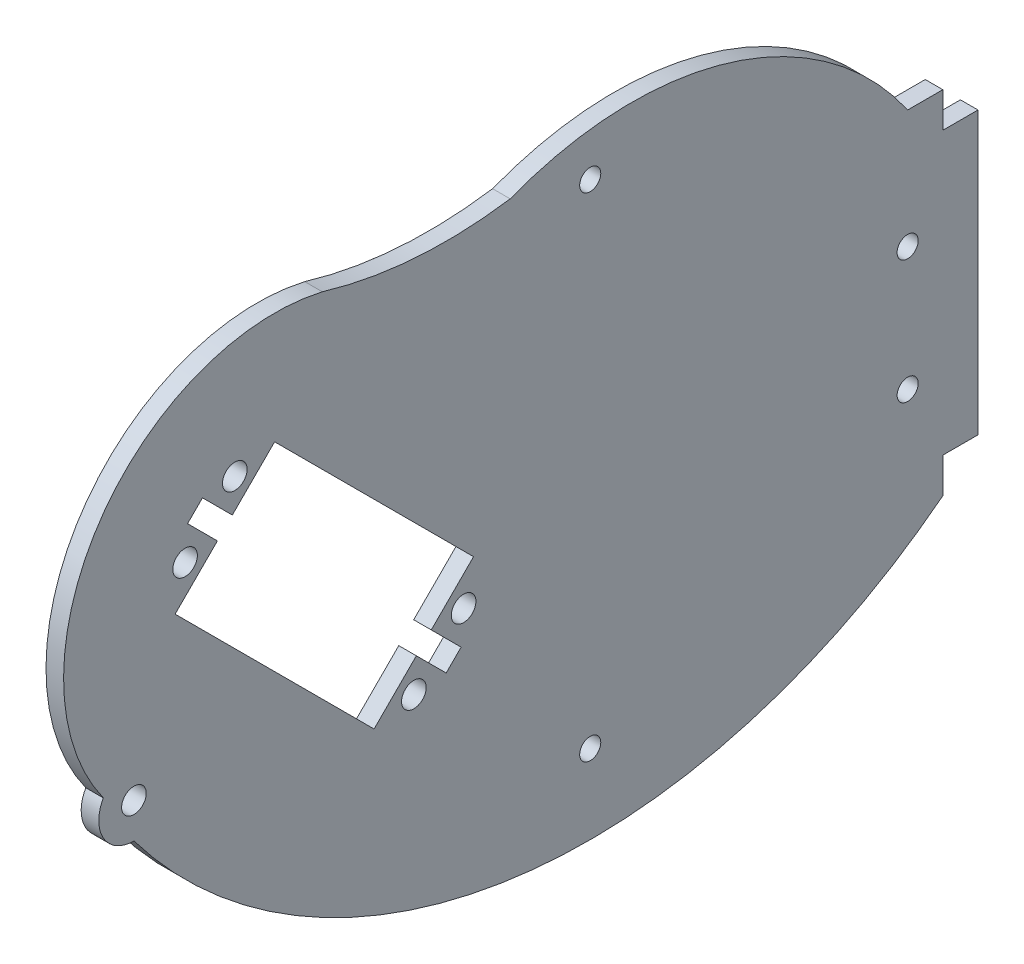
ISO-10303-21;
HEADER;
FILE_DESCRIPTION(('STEP AP214'),'2;1');
FILE_NAME('part.step','',(''),(''),'','','');
FILE_SCHEMA(('AUTOMOTIVE_DESIGN { 1 0 10303 214 1 1 1 1 }'));
ENDSEC;
DATA;
#1=APPLICATION_CONTEXT('core data for automotive mechanical design processes');
#2=APPLICATION_PROTOCOL_DEFINITION('international standard','automotive_design',2000,#1);
#3=PRODUCT_CONTEXT('',#1,'mechanical');
#4=PRODUCT('Part','Part','',(#3));
#5=PRODUCT_RELATED_PRODUCT_CATEGORY('part','',(#4));
#6=PRODUCT_DEFINITION_FORMATION('','',#4);
#7=PRODUCT_DEFINITION_CONTEXT('part definition',#1,'design');
#8=PRODUCT_DEFINITION('design','',#6,#7);
#9=PRODUCT_DEFINITION_SHAPE('','',#8);
#10=(LENGTH_UNIT() NAMED_UNIT(*) SI_UNIT(.MILLI.,.METRE.));
#11=(NAMED_UNIT(*) PLANE_ANGLE_UNIT() SI_UNIT($,.RADIAN.));
#12=(NAMED_UNIT(*) SI_UNIT($,.STERADIAN.) SOLID_ANGLE_UNIT());
#13=UNCERTAINTY_MEASURE_WITH_UNIT(LENGTH_MEASURE(1.E-05),#10,'distance_accuracy_value','');
#14=(GEOMETRIC_REPRESENTATION_CONTEXT(3) GLOBAL_UNCERTAINTY_ASSIGNED_CONTEXT((#13)) GLOBAL_UNIT_ASSIGNED_CONTEXT((#10,
#11,#12)) REPRESENTATION_CONTEXT('',''));
#15=CARTESIAN_POINT('',(0.,0.,0.));
#16=DIRECTION('',(0.,0.,1.));
#17=DIRECTION('',(1.,0.,0.));
#18=AXIS2_PLACEMENT_3D('',#15,#16,#17);
#19=CARTESIAN_POINT('',(2.5,-17.1347764973668,-50.7819266532157));
#20=DIRECTION('',(-1.,0.,0.));
#21=DIRECTION('',(0.,0.,1.));
#22=AXIS2_PLACEMENT_3D('',#19,#20,#21);
#23=PLANE('',#22);
#24=CARTESIAN_POINT('',(2.5,-46.0487768139737,-44.8711988503029));
#25=DIRECTION('',(1.,0.,0.));
#26=DIRECTION('',(0.,0.,-1.));
#27=AXIS2_PLACEMENT_3D('',#24,#25,#26);
#28=CIRCLE('',#27,1.5);
#29=CARTESIAN_POINT('',(2.5,-46.0487768139737,-46.3711988503029));
#30=VERTEX_POINT('',#29);
#31=EDGE_CURVE('E734',#30,#30,#28,.T.);
#32=ORIENTED_EDGE('',*,*,#31,.F.);
#33=EDGE_LOOP('',(#32));
#34=FACE_BOUND('',#33,.T.);
#35=CARTESIAN_POINT('',(2.5,-6.82118373479745,-89.9999999999999));
#36=DIRECTION('',(1.,0.,0.));
#37=DIRECTION('',(0.,0.,-1.));
#38=AXIS2_PLACEMENT_3D('',#35,#36,#37);
#39=CIRCLE('',#38,1.5);
#40=CARTESIAN_POINT('',(2.5,-6.82118373479745,-91.4999999999999));
#41=VERTEX_POINT('',#40);
#42=EDGE_CURVE('E746',#41,#41,#39,.T.);
#43=ORIENTED_EDGE('',*,*,#42,.F.);
#44=EDGE_LOOP('',(#43));
#45=FACE_BOUND('',#44,.T.);
#46=CARTESIAN_POINT('',(2.5,-26.8718903733424,-19.7971571849698));
#47=DIRECTION('',(1.,0.,0.));
#48=DIRECTION('',(0.,0.,-1.));
#49=AXIS2_PLACEMENT_3D('',#46,#47,#48);
#50=CIRCLE('',#49,1.74999999999991);
#51=CARTESIAN_POINT('',(2.5,-26.8718903733424,-21.5471571849697));
#52=VERTEX_POINT('',#51);
#53=EDGE_CURVE('E758',#52,#52,#50,.T.);
#54=ORIENTED_EDGE('',*,*,#53,.F.);
#55=EDGE_LOOP('',(#54));
#56=FACE_BOUND('',#55,.T.);
#57=CARTESIAN_POINT('',(2.5,12.7262989582942,5.65847735255609));
#58=DIRECTION('',(1.,0.,0.));
#59=DIRECTION('',(0.,0.,-1.));
#60=AXIS2_PLACEMENT_3D('',#57,#58,#59);
#61=CIRCLE('',#60,1.74999999999999);
#62=CARTESIAN_POINT('',(2.5,12.7262989582942,3.90847735255609));
#63=VERTEX_POINT('',#62);
#64=EDGE_CURVE('E770',#63,#63,#61,.T.);
#65=ORIENTED_EDGE('',*,*,#64,.F.);
#66=EDGE_LOOP('',(#65));
#67=FACE_BOUND('',#66,.T.);
#68=DIRECTION('',(0.,0.707106781186543,-0.707106781186552));
#69=VECTOR('',#68,1.);
#70=CARTESIAN_POINT('',(2.5,-20.1525432638166,-22.2738636073762));
#71=LINE('',#70,#69);
#72=CARTESIAN_POINT('',(2.5,-20.1525432638166,-22.2738636073762));
#73=VERTEX_POINT('',#72);
#74=CARTESIAN_POINT('',(2.5,-14.1421356237309,-28.2842712474619));
#75=VERTEX_POINT('',#74);
#76=EDGE_CURVE('E187',#73,#75,#71,.T.);
#77=ORIENTED_EDGE('',*,*,#76,.F.);
#78=DIRECTION('',(0.,0.707106781186549,0.707106781186546));
#79=VECTOR('',#78,1.);
#80=CARTESIAN_POINT('',(2.5,-24.3951839509359,-26.5165042944955));
#81=LINE('',#80,#79);
#82=CARTESIAN_POINT('',(2.5,-24.3951839509359,-26.5165042944955));
#83=VERTEX_POINT('',#82);
#84=EDGE_CURVE('E230',#83,#73,#81,.T.);
#85=ORIENTED_EDGE('',*,*,#84,.F.);
#86=DIRECTION('',(0.,0.707106781186551,-0.707106781186544));
#87=VECTOR('',#86,1.);
#88=CARTESIAN_POINT('',(2.5,-26.5183369827491,-24.3933512626823));
#89=LINE('',#88,#87);
#90=CARTESIAN_POINT('',(2.5,-26.5183369827491,-24.3933512626823));
#91=VERTEX_POINT('',#90);
#92=EDGE_CURVE('E228',#91,#83,#89,.T.);
#93=ORIENTED_EDGE('',*,*,#92,.F.);
#94=DIRECTION('',(0.,-0.707106781186558,-0.707106781186537));
#95=VECTOR('',#94,1.);
#96=CARTESIAN_POINT('',(2.5,-22.2756962956298,-20.150710575563));
#97=LINE('',#96,#95);
#98=CARTESIAN_POINT('',(2.5,-22.2756962956298,-20.150710575563));
#99=VERTEX_POINT('',#98);
#100=EDGE_CURVE('E226',#99,#91,#97,.T.);
#101=ORIENTED_EDGE('',*,*,#100,.F.);
#102=DIRECTION('',(0.,0.707106781186548,-0.707106781186547));
#103=VECTOR('',#102,1.);
#104=CARTESIAN_POINT('',(2.5,-28.2842712474619,-14.142135623731));
#105=LINE('',#104,#103);
#106=CARTESIAN_POINT('',(2.5,-28.2842712474619,-14.142135623731));
#107=VERTEX_POINT('',#106);
#108=EDGE_CURVE('E224',#107,#99,#105,.T.);
#109=ORIENTED_EDGE('',*,*,#108,.F.);
#110=DIRECTION('',(0.,-0.707106781186547,-0.707106781186548));
#111=VECTOR('',#110,1.);
#112=CARTESIAN_POINT('',(2.5,0.,14.142135623731));
#113=LINE('',#112,#111);
#114=CARTESIAN_POINT('',(2.5,0.,14.142135623731));
#115=VERTEX_POINT('',#114);
#116=EDGE_CURVE('E222',#115,#107,#113,.T.);
#117=ORIENTED_EDGE('',*,*,#116,.F.);
#118=DIRECTION('',(0.,-0.707106781186548,0.707106781186547));
#119=VECTOR('',#118,1.);
#120=CARTESIAN_POINT('',(2.5,6.01040764008564,8.1317279836453));
#121=LINE('',#120,#119);
#122=CARTESIAN_POINT('',(2.5,6.01040764008564,8.1317279836453));
#123=VERTEX_POINT('',#122);
#124=EDGE_CURVE('E220',#123,#115,#121,.T.);
#125=ORIENTED_EDGE('',*,*,#124,.F.);
#126=DIRECTION('',(0.,-0.707106781186547,-0.707106781186548));
#127=VECTOR('',#126,1.);
#128=CARTESIAN_POINT('',(2.5,10.2530483272049,12.3743686707646));
#129=LINE('',#128,#127);
#130=CARTESIAN_POINT('',(2.5,10.2530483272049,12.3743686707646));
#131=VERTEX_POINT('',#130);
#132=EDGE_CURVE('E218',#131,#123,#129,.T.);
#133=ORIENTED_EDGE('',*,*,#132,.F.);
#134=DIRECTION('',(0.,-0.707106781186547,0.707106781186547));
#135=VECTOR('',#134,1.);
#136=CARTESIAN_POINT('',(2.5,12.3743686707646,10.253048327205));
#137=LINE('',#136,#135);
#138=CARTESIAN_POINT('',(2.5,12.3743686707646,10.253048327205));
#139=VERTEX_POINT('',#138);
#140=EDGE_CURVE('E216',#139,#131,#137,.T.);
#141=ORIENTED_EDGE('',*,*,#140,.F.);
#142=DIRECTION('',(0.,0.707106781186547,0.707106781186548));
#143=VECTOR('',#142,1.);
#144=CARTESIAN_POINT('',(2.5,8.13172798364529,6.01040764008567));
#145=LINE('',#144,#143);
#146=CARTESIAN_POINT('',(2.5,8.13172798364529,6.01040764008567));
#147=VERTEX_POINT('',#146);
#148=EDGE_CURVE('E211',#147,#139,#145,.T.);
#149=ORIENTED_EDGE('',*,*,#148,.F.);
#150=DIRECTION('',(0.,-0.707106781186546,0.707106781186549));
#151=VECTOR('',#150,1.);
#152=CARTESIAN_POINT('',(2.5,14.1421356237309,0.));
#153=LINE('',#152,#151);
#154=CARTESIAN_POINT('',(2.5,14.1421356237309,0.));
#155=VERTEX_POINT('',#154);
#156=EDGE_CURVE('E209',#155,#147,#153,.T.);
#157=ORIENTED_EDGE('',*,*,#156,.F.);
#158=DIRECTION('',(0.,0.707106781186547,0.707106781186548));
#159=VECTOR('',#158,1.);
#160=CARTESIAN_POINT('',(2.5,-14.1421356237309,-28.2842712474619));
#161=LINE('',#160,#159);
#162=EDGE_CURVE('E195',#75,#155,#161,.T.);
#163=ORIENTED_EDGE('',*,*,#162,.F.);
#164=EDGE_LOOP('',(#77,#85,#93,#101,#109,#117,#125,#133,#141,#149,#157,#163));
#165=FACE_BOUND('',#164,.T.);
#166=CARTESIAN_POINT('',(2.5,-17.1347764973668,-50.7819266532157));
#167=DIRECTION('',(1.,0.,0.));
#168=DIRECTION('',(0.,0.,1.));
#169=AXIS2_PLACEMENT_3D('',#166,#167,#168);
#170=CIRCLE('',#169,47.6901810920843);
#171=CARTESIAN_POINT('',(2.5,10.,-89.9999999999999));
#172=VERTEX_POINT('',#171);
#173=CARTESIAN_POINT('',(2.5,27.3116487053127,-33.4941084190252));
#174=VERTEX_POINT('',#173);
#175=EDGE_CURVE('E283',#172,#174,#170,.T.);
#176=ORIENTED_EDGE('',*,*,#175,.T.);
#177=CARTESIAN_POINT('',(2.5,87.7830578531458,-24.3979033665495));
#178=DIRECTION('',(-1.,0.,0.));
#179=DIRECTION('',(0.,0.,-1.));
#180=AXIS2_PLACEMENT_3D('',#177,#178,#179);
#181=CIRCLE('',#180,61.1517151900199);
#182=CARTESIAN_POINT('',(2.5,29.2225875766442,-6.78530583874873));
#183=VERTEX_POINT('',#182);
#184=EDGE_CURVE('E286',#174,#183,#181,.T.);
#185=ORIENTED_EDGE('',*,*,#184,.T.);
#186=CARTESIAN_POINT('',(2.5,0.,0.));
#187=DIRECTION('',(1.,0.,0.));
#188=DIRECTION('',(0.,0.,-1.));
#189=AXIS2_PLACEMENT_3D('',#186,#187,#188);
#190=CIRCLE('',#189,30.);
#191=CARTESIAN_POINT('',(2.5,-17.5285274641763,24.3464725358237));
#192=VERTEX_POINT('',#191);
#193=EDGE_CURVE('E289',#183,#192,#190,.T.);
#194=ORIENTED_EDGE('',*,*,#193,.T.);
#195=CARTESIAN_POINT('',(2.5,-20.,20.));
#196=DIRECTION('',(1.,0.,0.));
#197=DIRECTION('',(0.,0.,-1.));
#198=AXIS2_PLACEMENT_3D('',#195,#196,#197);
#199=CIRCLE('',#198,5.);
#200=CARTESIAN_POINT('',(2.5,-25.,20.));
#201=VERTEX_POINT('',#200);
#202=EDGE_CURVE('E291',#192,#201,#199,.T.);
#203=ORIENTED_EDGE('',*,*,#202,.T.);
#204=CARTESIAN_POINT('',(2.5,24.012524518989,-44.8711988503029));
#205=DIRECTION('',(1.,0.,0.));
#206=DIRECTION('',(0.,0.,-1.));
#207=AXIS2_PLACEMENT_3D('',#204,#205,#206);
#208=CIRCLE('',#207,81.3049813972061);
#209=CARTESIAN_POINT('',(2.5,-40.,-95.));
#210=VERTEX_POINT('',#209);
#211=EDGE_CURVE('E293',#201,#210,#208,.T.);
#212=ORIENTED_EDGE('',*,*,#211,.T.);
#213=DIRECTION('',(0.,1.,0.));
#214=VECTOR('',#213,1.);
#215=CARTESIAN_POINT('',(2.5,-40.,-95.));
#216=LINE('',#215,#214);
#217=CARTESIAN_POINT('',(2.5,-35.,-95.));
#218=VERTEX_POINT('',#217);
#219=EDGE_CURVE('E295',#210,#218,#216,.T.);
#220=ORIENTED_EDGE('',*,*,#219,.T.);
#221=DIRECTION('',(0.,0.,-1.));
#222=VECTOR('',#221,1.);
#223=CARTESIAN_POINT('',(2.5,-35.,-95.));
#224=LINE('',#223,#222);
#225=CARTESIAN_POINT('',(2.5,-35.,-100.));
#226=VERTEX_POINT('',#225);
#227=EDGE_CURVE('E297',#218,#226,#224,.T.);
#228=ORIENTED_EDGE('',*,*,#227,.T.);
#229=DIRECTION('',(0.,1.,0.));
#230=VECTOR('',#229,1.);
#231=CARTESIAN_POINT('',(2.5,-35.,-100.));
#232=LINE('',#231,#230);
#233=CARTESIAN_POINT('',(2.5,5.,-100.));
#234=VERTEX_POINT('',#233);
#235=EDGE_CURVE('E299',#226,#234,#232,.T.);
#236=ORIENTED_EDGE('',*,*,#235,.T.);
#237=DIRECTION('',(0.,0.,1.));
#238=VECTOR('',#237,1.);
#239=CARTESIAN_POINT('',(2.5,5.,-100.));
#240=LINE('',#239,#238);
#241=CARTESIAN_POINT('',(2.5,5.,-95.));
#242=VERTEX_POINT('',#241);
#243=EDGE_CURVE('E301',#234,#242,#240,.T.);
#244=ORIENTED_EDGE('',*,*,#243,.T.);
#245=DIRECTION('',(0.,1.,0.));
#246=VECTOR('',#245,1.);
#247=CARTESIAN_POINT('',(2.5,10.,-95.));
#248=LINE('',#247,#246);
#249=CARTESIAN_POINT('',(2.5,10.,-95.));
#250=VERTEX_POINT('',#249);
#251=EDGE_CURVE('E303',#242,#250,#248,.T.);
#252=ORIENTED_EDGE('',*,*,#251,.T.);
#253=DIRECTION('',(0.,0.,1.));
#254=VECTOR('',#253,1.);
#255=CARTESIAN_POINT('',(2.5,10.,-95.));
#256=LINE('',#255,#254);
#257=EDGE_CURVE('E305',#250,#172,#256,.T.);
#258=ORIENTED_EDGE('',*,*,#257,.T.);
#259=EDGE_LOOP('',(#176,#185,#194,#203,#212,#220,#228,#236,#244,#252,#258));
#260=FACE_BOUND('',#259,.T.);
#261=CARTESIAN_POINT('',(2.5,5.65469890889873,12.7300774019515));
#262=DIRECTION('',(1.,0.,0.));
#263=DIRECTION('',(0.,0.,-1.));
#264=AXIS2_PLACEMENT_3D('',#261,#262,#263);
#265=CIRCLE('',#264,1.75);
#266=CARTESIAN_POINT('',(2.5,5.65469890889873,10.9800774019515));
#267=VERTEX_POINT('',#266);
#268=EDGE_CURVE('E233',#267,#267,#265,.T.);
#269=ORIENTED_EDGE('',*,*,#268,.F.);
#270=EDGE_LOOP('',(#269));
#271=FACE_BOUND('',#270,.T.);
#272=CARTESIAN_POINT('',(2.5,-19.7989898732233,-26.8700576850888));
#273=DIRECTION('',(1.,0.,0.));
#274=DIRECTION('',(0.,0.,-1.));
#275=AXIS2_PLACEMENT_3D('',#272,#273,#274);
#276=CIRCLE('',#275,1.75000000000001);
#277=CARTESIAN_POINT('',(2.5,-19.7989898732233,-28.6200576850888));
#278=VERTEX_POINT('',#277);
#279=EDGE_CURVE('E764',#278,#278,#276,.T.);
#280=ORIENTED_EDGE('',*,*,#279,.F.);
#281=EDGE_LOOP('',(#280));
#282=FACE_BOUND('',#281,.T.);
#283=CARTESIAN_POINT('',(2.5,-20.,20.));
#284=DIRECTION('',(1.,0.,0.));
#285=DIRECTION('',(0.,0.,-1.));
#286=AXIS2_PLACEMENT_3D('',#283,#284,#285);
#287=CIRCLE('',#286,1.75);
#288=CARTESIAN_POINT('',(2.5,-20.,18.25));
#289=VERTEX_POINT('',#288);
#290=EDGE_CURVE('E752',#289,#289,#287,.T.);
#291=ORIENTED_EDGE('',*,*,#290,.F.);
#292=EDGE_LOOP('',(#291));
#293=FACE_BOUND('',#292,.T.);
#294=CARTESIAN_POINT('',(2.5,-24.3951839509359,-89.9999999999999));
#295=DIRECTION('',(1.,0.,0.));
#296=DIRECTION('',(0.,0.,-1.));
#297=AXIS2_PLACEMENT_3D('',#294,#295,#296);
#298=CIRCLE('',#297,1.5);
#299=CARTESIAN_POINT('',(2.5,-24.3951839509359,-91.4999999999999));
#300=VERTEX_POINT('',#299);
#301=EDGE_CURVE('E740',#300,#300,#298,.T.);
#302=ORIENTED_EDGE('',*,*,#301,.F.);
#303=EDGE_LOOP('',(#302));
#304=FACE_BOUND('',#303,.T.);
#305=CARTESIAN_POINT('',(2.5,24.012524518989,-44.8711988503029));
#306=DIRECTION('',(1.,0.,0.));
#307=DIRECTION('',(0.,0.,-1.));
#308=AXIS2_PLACEMENT_3D('',#305,#306,#307);
#309=CIRCLE('',#308,1.5);
#310=CARTESIAN_POINT('',(2.5,24.012524518989,-46.3711988503029));
#311=VERTEX_POINT('',#310);
#312=EDGE_CURVE('E725',#311,#311,#309,.T.);
#313=ORIENTED_EDGE('',*,*,#312,.F.);
#314=EDGE_LOOP('',(#313));
#315=FACE_BOUND('',#314,.T.);
#316=ADVANCED_FACE('F32',(#34,#45,#56,#67,#165,#260,#271,#282,#293,#304,#315),#23,.F.);
#317=CARTESIAN_POINT('',(0.,-17.1347764973668,-50.7819266532157));
#318=DIRECTION('',(-1.,0.,0.));
#319=DIRECTION('',(0.,0.,1.));
#320=AXIS2_PLACEMENT_3D('',#317,#318,#319);
#321=PLANE('',#320);
#322=CARTESIAN_POINT('',(0.,-46.0487768139737,-44.8711988503029));
#323=DIRECTION('',(1.,0.,0.));
#324=DIRECTION('',(0.,0.,-1.));
#325=AXIS2_PLACEMENT_3D('',#322,#323,#324);
#326=CIRCLE('',#325,1.5);
#327=CARTESIAN_POINT('',(0.,-46.0487768139737,-46.3711988503029));
#328=VERTEX_POINT('',#327);
#329=EDGE_CURVE('E731',#328,#328,#326,.T.);
#330=ORIENTED_EDGE('',*,*,#329,.T.);
#331=EDGE_LOOP('',(#330));
#332=FACE_BOUND('',#331,.T.);
#333=CARTESIAN_POINT('',(0.,-6.82118373479745,-89.9999999999999));
#334=DIRECTION('',(1.,0.,0.));
#335=DIRECTION('',(0.,0.,-1.));
#336=AXIS2_PLACEMENT_3D('',#333,#334,#335);
#337=CIRCLE('',#336,1.5);
#338=CARTESIAN_POINT('',(0.,-6.82118373479745,-91.4999999999999));
#339=VERTEX_POINT('',#338);
#340=EDGE_CURVE('E743',#339,#339,#337,.T.);
#341=ORIENTED_EDGE('',*,*,#340,.T.);
#342=EDGE_LOOP('',(#341));
#343=FACE_BOUND('',#342,.T.);
#344=CARTESIAN_POINT('',(0.,-26.8718903733424,-19.7971571849698));
#345=DIRECTION('',(1.,0.,0.));
#346=DIRECTION('',(0.,0.,-1.));
#347=AXIS2_PLACEMENT_3D('',#344,#345,#346);
#348=CIRCLE('',#347,1.74999999999991);
#349=CARTESIAN_POINT('',(0.,-26.8718903733424,-21.5471571849697));
#350=VERTEX_POINT('',#349);
#351=EDGE_CURVE('E755',#350,#350,#348,.T.);
#352=ORIENTED_EDGE('',*,*,#351,.T.);
#353=EDGE_LOOP('',(#352));
#354=FACE_BOUND('',#353,.T.);
#355=CARTESIAN_POINT('',(0.,12.7262989582942,5.65847735255609));
#356=DIRECTION('',(1.,0.,0.));
#357=DIRECTION('',(0.,0.,-1.));
#358=AXIS2_PLACEMENT_3D('',#355,#356,#357);
#359=CIRCLE('',#358,1.74999999999999);
#360=CARTESIAN_POINT('',(0.,12.7262989582942,3.90847735255609));
#361=VERTEX_POINT('',#360);
#362=EDGE_CURVE('E767',#361,#361,#359,.T.);
#363=ORIENTED_EDGE('',*,*,#362,.T.);
#364=EDGE_LOOP('',(#363));
#365=FACE_BOUND('',#364,.T.);
#366=DIRECTION('',(0.,0.707106781186549,0.707106781186546));
#367=VECTOR('',#366,1.);
#368=CARTESIAN_POINT('',(0.,-24.3951839509359,-26.5165042944955));
#369=LINE('',#368,#367);
#370=CARTESIAN_POINT('',(0.,-24.3951839509359,-26.5165042944955));
#371=VERTEX_POINT('',#370);
#372=CARTESIAN_POINT('',(0.,-20.1525432638166,-22.2738636073762));
#373=VERTEX_POINT('',#372);
#374=EDGE_CURVE('E196',#371,#373,#369,.T.);
#375=ORIENTED_EDGE('',*,*,#374,.T.);
#376=DIRECTION('',(0.,0.707106781186543,-0.707106781186552));
#377=VECTOR('',#376,1.);
#378=CARTESIAN_POINT('',(0.,-20.1525432638166,-22.2738636073762));
#379=LINE('',#378,#377);
#380=CARTESIAN_POINT('',(0.,-14.1421356237309,-28.2842712474619));
#381=VERTEX_POINT('',#380);
#382=EDGE_CURVE('E55',#373,#381,#379,.T.);
#383=ORIENTED_EDGE('',*,*,#382,.T.);
#384=DIRECTION('',(0.,0.707106781186547,0.707106781186548));
#385=VECTOR('',#384,1.);
#386=CARTESIAN_POINT('',(0.,-14.1421356237309,-28.2842712474619));
#387=LINE('',#386,#385);
#388=CARTESIAN_POINT('',(0.,14.1421356237309,0.));
#389=VERTEX_POINT('',#388);
#390=EDGE_CURVE('E202',#381,#389,#387,.T.);
#391=ORIENTED_EDGE('',*,*,#390,.T.);
#392=DIRECTION('',(0.,-0.707106781186546,0.707106781186549));
#393=VECTOR('',#392,1.);
#394=CARTESIAN_POINT('',(0.,14.1421356237309,0.));
#395=LINE('',#394,#393);
#396=CARTESIAN_POINT('',(0.,8.13172798364529,6.01040764008567));
#397=VERTEX_POINT('',#396);
#398=EDGE_CURVE('E235',#389,#397,#395,.T.);
#399=ORIENTED_EDGE('',*,*,#398,.T.);
#400=DIRECTION('',(0.,0.707106781186547,0.707106781186548));
#401=VECTOR('',#400,1.);
#402=CARTESIAN_POINT('',(0.,8.13172798364529,6.01040764008567));
#403=LINE('',#402,#401);
#404=CARTESIAN_POINT('',(0.,12.3743686707646,10.253048327205));
#405=VERTEX_POINT('',#404);
#406=EDGE_CURVE('E238',#397,#405,#403,.T.);
#407=ORIENTED_EDGE('',*,*,#406,.T.);
#408=DIRECTION('',(0.,-0.707106781186547,0.707106781186547));
#409=VECTOR('',#408,1.);
#410=CARTESIAN_POINT('',(0.,12.3743686707646,10.253048327205));
#411=LINE('',#410,#409);
#412=CARTESIAN_POINT('',(0.,10.2530483272049,12.3743686707646));
#413=VERTEX_POINT('',#412);
#414=EDGE_CURVE('E241',#405,#413,#411,.T.);
#415=ORIENTED_EDGE('',*,*,#414,.T.);
#416=DIRECTION('',(0.,-0.707106781186547,-0.707106781186548));
#417=VECTOR('',#416,1.);
#418=CARTESIAN_POINT('',(0.,10.2530483272049,12.3743686707646));
#419=LINE('',#418,#417);
#420=CARTESIAN_POINT('',(0.,6.01040764008564,8.1317279836453));
#421=VERTEX_POINT('',#420);
#422=EDGE_CURVE('E244',#413,#421,#419,.T.);
#423=ORIENTED_EDGE('',*,*,#422,.T.);
#424=DIRECTION('',(0.,-0.707106781186548,0.707106781186547));
#425=VECTOR('',#424,1.);
#426=CARTESIAN_POINT('',(0.,6.01040764008564,8.1317279836453));
#427=LINE('',#426,#425);
#428=CARTESIAN_POINT('',(0.,0.,14.142135623731));
#429=VERTEX_POINT('',#428);
#430=EDGE_CURVE('E247',#421,#429,#427,.T.);
#431=ORIENTED_EDGE('',*,*,#430,.T.);
#432=DIRECTION('',(0.,-0.707106781186547,-0.707106781186548));
#433=VECTOR('',#432,1.);
#434=CARTESIAN_POINT('',(0.,0.,14.142135623731));
#435=LINE('',#434,#433);
#436=CARTESIAN_POINT('',(0.,-28.2842712474619,-14.142135623731));
#437=VERTEX_POINT('',#436);
#438=EDGE_CURVE('E250',#429,#437,#435,.T.);
#439=ORIENTED_EDGE('',*,*,#438,.T.);
#440=DIRECTION('',(0.,0.707106781186548,-0.707106781186547));
#441=VECTOR('',#440,1.);
#442=CARTESIAN_POINT('',(0.,-28.2842712474619,-14.142135623731));
#443=LINE('',#442,#441);
#444=CARTESIAN_POINT('',(0.,-22.2756962956298,-20.150710575563));
#445=VERTEX_POINT('',#444);
#446=EDGE_CURVE('E253',#437,#445,#443,.T.);
#447=ORIENTED_EDGE('',*,*,#446,.T.);
#448=DIRECTION('',(0.,-0.707106781186558,-0.707106781186537));
#449=VECTOR('',#448,1.);
#450=CARTESIAN_POINT('',(0.,-22.2756962956298,-20.150710575563));
#451=LINE('',#450,#449);
#452=CARTESIAN_POINT('',(0.,-26.5183369827491,-24.3933512626823));
#453=VERTEX_POINT('',#452);
#454=EDGE_CURVE('E256',#445,#453,#451,.T.);
#455=ORIENTED_EDGE('',*,*,#454,.T.);
#456=DIRECTION('',(0.,0.707106781186551,-0.707106781186544));
#457=VECTOR('',#456,1.);
#458=CARTESIAN_POINT('',(0.,-26.5183369827491,-24.3933512626823));
#459=LINE('',#458,#457);
#460=EDGE_CURVE('E259',#453,#371,#459,.T.);
#461=ORIENTED_EDGE('',*,*,#460,.T.);
#462=EDGE_LOOP('',(#375,#383,#391,#399,#407,#415,#423,#431,#439,#447,#455,#461));
#463=FACE_BOUND('',#462,.T.);
#464=CARTESIAN_POINT('',(0.,-17.1347764973668,-50.7819266532157));
#465=DIRECTION('',(1.,0.,0.));
#466=DIRECTION('',(0.,0.,1.));
#467=AXIS2_PLACEMENT_3D('',#464,#465,#466);
#468=CIRCLE('',#467,47.6901810920843);
#469=CARTESIAN_POINT('',(0.,10.,-89.9999999999999));
#470=VERTEX_POINT('',#469);
#471=CARTESIAN_POINT('',(0.,27.3116487053127,-33.4941084190252));
#472=VERTEX_POINT('',#471);
#473=EDGE_CURVE('E203',#470,#472,#468,.T.);
#474=ORIENTED_EDGE('',*,*,#473,.F.);
#475=DIRECTION('',(0.,0.,1.));
#476=VECTOR('',#475,1.);
#477=CARTESIAN_POINT('',(0.,10.,-95.));
#478=LINE('',#477,#476);
#479=CARTESIAN_POINT('',(0.,10.,-95.));
#480=VERTEX_POINT('',#479);
#481=EDGE_CURVE('E287',#480,#470,#478,.T.);
#482=ORIENTED_EDGE('',*,*,#481,.F.);
#483=DIRECTION('',(0.,1.,0.));
#484=VECTOR('',#483,1.);
#485=CARTESIAN_POINT('',(0.,10.,-95.));
#486=LINE('',#485,#484);
#487=CARTESIAN_POINT('',(0.,5.,-95.));
#488=VERTEX_POINT('',#487);
#489=EDGE_CURVE('E326',#488,#480,#486,.T.);
#490=ORIENTED_EDGE('',*,*,#489,.F.);
#491=DIRECTION('',(0.,0.,1.));
#492=VECTOR('',#491,1.);
#493=CARTESIAN_POINT('',(0.,5.,-100.));
#494=LINE('',#493,#492);
#495=CARTESIAN_POINT('',(0.,5.,-100.));
#496=VERTEX_POINT('',#495);
#497=EDGE_CURVE('E324',#496,#488,#494,.T.);
#498=ORIENTED_EDGE('',*,*,#497,.F.);
#499=DIRECTION('',(0.,1.,0.));
#500=VECTOR('',#499,1.);
#501=CARTESIAN_POINT('',(0.,-35.,-100.));
#502=LINE('',#501,#500);
#503=CARTESIAN_POINT('',(0.,-35.,-100.));
#504=VERTEX_POINT('',#503);
#505=EDGE_CURVE('E322',#504,#496,#502,.T.);
#506=ORIENTED_EDGE('',*,*,#505,.F.);
#507=DIRECTION('',(0.,0.,-1.));
#508=VECTOR('',#507,1.);
#509=CARTESIAN_POINT('',(0.,-35.,-95.));
#510=LINE('',#509,#508);
#511=CARTESIAN_POINT('',(0.,-35.,-95.));
#512=VERTEX_POINT('',#511);
#513=EDGE_CURVE('E320',#512,#504,#510,.T.);
#514=ORIENTED_EDGE('',*,*,#513,.F.);
#515=DIRECTION('',(0.,1.,0.));
#516=VECTOR('',#515,1.);
#517=CARTESIAN_POINT('',(0.,-40.,-95.));
#518=LINE('',#517,#516);
#519=CARTESIAN_POINT('',(0.,-40.,-95.));
#520=VERTEX_POINT('',#519);
#521=EDGE_CURVE('E318',#520,#512,#518,.T.);
#522=ORIENTED_EDGE('',*,*,#521,.F.);
#523=CARTESIAN_POINT('',(0.,24.012524518989,-44.8711988503029));
#524=DIRECTION('',(1.,0.,0.));
#525=DIRECTION('',(0.,0.,-1.));
#526=AXIS2_PLACEMENT_3D('',#523,#524,#525);
#527=CIRCLE('',#526,81.3049813972061);
#528=CARTESIAN_POINT('',(0.,-25.,20.));
#529=VERTEX_POINT('',#528);
#530=EDGE_CURVE('E316',#529,#520,#527,.T.);
#531=ORIENTED_EDGE('',*,*,#530,.F.);
#532=CARTESIAN_POINT('',(0.,-20.,20.));
#533=DIRECTION('',(1.,0.,0.));
#534=DIRECTION('',(0.,0.,-1.));
#535=AXIS2_PLACEMENT_3D('',#532,#533,#534);
#536=CIRCLE('',#535,5.);
#537=CARTESIAN_POINT('',(0.,-17.5285274641763,24.3464725358237));
#538=VERTEX_POINT('',#537);
#539=EDGE_CURVE('E314',#538,#529,#536,.T.);
#540=ORIENTED_EDGE('',*,*,#539,.F.);
#541=CARTESIAN_POINT('',(0.,0.,0.));
#542=DIRECTION('',(1.,0.,0.));
#543=DIRECTION('',(0.,0.,-1.));
#544=AXIS2_PLACEMENT_3D('',#541,#542,#543);
#545=CIRCLE('',#544,30.);
#546=CARTESIAN_POINT('',(0.,29.2225875766442,-6.78530583874873));
#547=VERTEX_POINT('',#546);
#548=EDGE_CURVE('E312',#547,#538,#545,.T.);
#549=ORIENTED_EDGE('',*,*,#548,.F.);
#550=CARTESIAN_POINT('',(0.,87.7830578531458,-24.3979033665495));
#551=DIRECTION('',(-1.,0.,0.));
#552=DIRECTION('',(0.,0.,-1.));
#553=AXIS2_PLACEMENT_3D('',#550,#551,#552);
#554=CIRCLE('',#553,61.1517151900199);
#555=EDGE_CURVE('E310',#472,#547,#554,.T.);
#556=ORIENTED_EDGE('',*,*,#555,.F.);
#557=EDGE_LOOP('',(#474,#482,#490,#498,#506,#514,#522,#531,#540,#549,#556));
#558=FACE_BOUND('',#557,.T.);
#559=CARTESIAN_POINT('',(0.,5.65469890889873,12.7300774019515));
#560=DIRECTION('',(1.,0.,0.));
#561=DIRECTION('',(0.,0.,-1.));
#562=AXIS2_PLACEMENT_3D('',#559,#560,#561);
#563=CIRCLE('',#562,1.75);
#564=CARTESIAN_POINT('',(0.,5.65469890889873,10.9800774019515));
#565=VERTEX_POINT('',#564);
#566=EDGE_CURVE('E773',#565,#565,#563,.T.);
#567=ORIENTED_EDGE('',*,*,#566,.T.);
#568=EDGE_LOOP('',(#567));
#569=FACE_BOUND('',#568,.T.);
#570=CARTESIAN_POINT('',(0.,-19.7989898732233,-26.8700576850888));
#571=DIRECTION('',(1.,0.,0.));
#572=DIRECTION('',(0.,0.,-1.));
#573=AXIS2_PLACEMENT_3D('',#570,#571,#572);
#574=CIRCLE('',#573,1.75000000000001);
#575=CARTESIAN_POINT('',(0.,-19.7989898732233,-28.6200576850888));
#576=VERTEX_POINT('',#575);
#577=EDGE_CURVE('E761',#576,#576,#574,.T.);
#578=ORIENTED_EDGE('',*,*,#577,.T.);
#579=EDGE_LOOP('',(#578));
#580=FACE_BOUND('',#579,.T.);
#581=CARTESIAN_POINT('',(0.,-20.,20.));
#582=DIRECTION('',(1.,0.,0.));
#583=DIRECTION('',(0.,0.,-1.));
#584=AXIS2_PLACEMENT_3D('',#581,#582,#583);
#585=CIRCLE('',#584,1.75);
#586=CARTESIAN_POINT('',(0.,-20.,18.25));
#587=VERTEX_POINT('',#586);
#588=EDGE_CURVE('E749',#587,#587,#585,.T.);
#589=ORIENTED_EDGE('',*,*,#588,.T.);
#590=EDGE_LOOP('',(#589));
#591=FACE_BOUND('',#590,.T.);
#592=CARTESIAN_POINT('',(0.,-24.3951839509359,-89.9999999999999));
#593=DIRECTION('',(1.,0.,0.));
#594=DIRECTION('',(0.,0.,-1.));
#595=AXIS2_PLACEMENT_3D('',#592,#593,#594);
#596=CIRCLE('',#595,1.5);
#597=CARTESIAN_POINT('',(0.,-24.3951839509359,-91.4999999999999));
#598=VERTEX_POINT('',#597);
#599=EDGE_CURVE('E737',#598,#598,#596,.T.);
#600=ORIENTED_EDGE('',*,*,#599,.T.);
#601=EDGE_LOOP('',(#600));
#602=FACE_BOUND('',#601,.T.);
#603=CARTESIAN_POINT('',(0.,24.012524518989,-44.8711988503029));
#604=DIRECTION('',(1.,0.,0.));
#605=DIRECTION('',(0.,0.,-1.));
#606=AXIS2_PLACEMENT_3D('',#603,#604,#605);
#607=CIRCLE('',#606,1.5);
#608=CARTESIAN_POINT('',(0.,24.012524518989,-46.3711988503029));
#609=VERTEX_POINT('',#608);
#610=EDGE_CURVE('E728',#609,#609,#607,.T.);
#611=ORIENTED_EDGE('',*,*,#610,.T.);
#612=EDGE_LOOP('',(#611));
#613=FACE_BOUND('',#612,.T.);
#614=ADVANCED_FACE('F365',(#332,#343,#354,#365,#463,#558,#569,#580,#591,#602,#613),#321,.T.);
#615=CARTESIAN_POINT('',(2.5,-17.1347764973668,-50.7819266532157));
#616=DIRECTION('',(-1.,0.,0.));
#617=DIRECTION('',(0.,0.,1.));
#618=AXIS2_PLACEMENT_3D('',#615,#616,#617);
#619=CYLINDRICAL_SURFACE('',#618,47.6901810920843);
#620=ORIENTED_EDGE('',*,*,#473,.T.);
#621=DIRECTION('',(-1.,0.,0.));
#622=VECTOR('',#621,1.);
#623=CARTESIAN_POINT('',(2.5,27.3116487053127,-33.4941084190252));
#624=LINE('',#623,#622);
#625=EDGE_CURVE('E11',#174,#472,#624,.T.);
#626=ORIENTED_EDGE('',*,*,#625,.F.);
#627=ORIENTED_EDGE('',*,*,#175,.F.);
#628=DIRECTION('',(-1.,0.,0.));
#629=VECTOR('',#628,1.);
#630=CARTESIAN_POINT('',(2.5,10.,-89.9999999999999));
#631=LINE('',#630,#629);
#632=EDGE_CURVE('E307',#172,#470,#631,.T.);
#633=ORIENTED_EDGE('',*,*,#632,.T.);
#634=EDGE_LOOP('',(#620,#626,#627,#633));
#635=FACE_BOUND('',#634,.T.);
#636=ADVANCED_FACE('F34',(#635),#619,.T.);
#637=CARTESIAN_POINT('',(2.5,87.7830578531458,-24.3979033665495));
#638=DIRECTION('',(-1.,0.,0.));
#639=DIRECTION('',(0.,0.,1.));
#640=AXIS2_PLACEMENT_3D('',#637,#638,#639);
#641=CYLINDRICAL_SURFACE('',#640,61.1517151900199);
#642=ORIENTED_EDGE('',*,*,#555,.T.);
#643=DIRECTION('',(-1.,0.,0.));
#644=VECTOR('',#643,1.);
#645=CARTESIAN_POINT('',(2.5,29.2225875766442,-6.78530583874873));
#646=LINE('',#645,#644);
#647=EDGE_CURVE('E40',#183,#547,#646,.T.);
#648=ORIENTED_EDGE('',*,*,#647,.F.);
#649=ORIENTED_EDGE('',*,*,#184,.F.);
#650=ORIENTED_EDGE('',*,*,#625,.T.);
#651=EDGE_LOOP('',(#642,#648,#649,#650));
#652=FACE_BOUND('',#651,.T.);
#653=ADVANCED_FACE('F382',(#652),#641,.F.);
#654=CARTESIAN_POINT('',(2.5,0.,0.));
#655=DIRECTION('',(-1.,0.,0.));
#656=DIRECTION('',(0.,0.,1.));
#657=AXIS2_PLACEMENT_3D('',#654,#655,#656);
#658=CYLINDRICAL_SURFACE('',#657,30.);
#659=ORIENTED_EDGE('',*,*,#548,.T.);
#660=DIRECTION('',(-1.,0.,0.));
#661=VECTOR('',#660,1.);
#662=CARTESIAN_POINT('',(2.5,-17.5285274641763,24.3464725358237));
#663=LINE('',#662,#661);
#664=EDGE_CURVE('E352',#192,#538,#663,.T.);
#665=ORIENTED_EDGE('',*,*,#664,.F.);
#666=ORIENTED_EDGE('',*,*,#193,.F.);
#667=ORIENTED_EDGE('',*,*,#647,.T.);
#668=EDGE_LOOP('',(#659,#665,#666,#667));
#669=FACE_BOUND('',#668,.T.);
#670=ADVANCED_FACE('F359',(#669),#658,.T.);
#671=CARTESIAN_POINT('',(2.5,-20.,20.));
#672=DIRECTION('',(-1.,0.,0.));
#673=DIRECTION('',(0.,0.,1.));
#674=AXIS2_PLACEMENT_3D('',#671,#672,#673);
#675=CYLINDRICAL_SURFACE('',#674,5.);
#676=ORIENTED_EDGE('',*,*,#539,.T.);
#677=DIRECTION('',(-1.,0.,0.));
#678=VECTOR('',#677,1.);
#679=CARTESIAN_POINT('',(2.5,-25.,20.));
#680=LINE('',#679,#678);
#681=EDGE_CURVE('E349',#201,#529,#680,.T.);
#682=ORIENTED_EDGE('',*,*,#681,.F.);
#683=ORIENTED_EDGE('',*,*,#202,.F.);
#684=ORIENTED_EDGE('',*,*,#664,.T.);
#685=EDGE_LOOP('',(#676,#682,#683,#684));
#686=FACE_BOUND('',#685,.T.);
#687=ADVANCED_FACE('F371',(#686),#675,.T.);
#688=CARTESIAN_POINT('',(2.5,24.012524518989,-44.8711988503029));
#689=DIRECTION('',(-1.,0.,0.));
#690=DIRECTION('',(0.,0.,1.));
#691=AXIS2_PLACEMENT_3D('',#688,#689,#690);
#692=CYLINDRICAL_SURFACE('',#691,81.3049813972061);
#693=ORIENTED_EDGE('',*,*,#530,.T.);
#694=DIRECTION('',(-1.,0.,0.));
#695=VECTOR('',#694,1.);
#696=CARTESIAN_POINT('',(2.5,-40.,-95.));
#697=LINE('',#696,#695);
#698=EDGE_CURVE('E346',#210,#520,#697,.T.);
#699=ORIENTED_EDGE('',*,*,#698,.F.);
#700=ORIENTED_EDGE('',*,*,#211,.F.);
#701=ORIENTED_EDGE('',*,*,#681,.T.);
#702=EDGE_LOOP('',(#693,#699,#700,#701));
#703=FACE_BOUND('',#702,.T.);
#704=ADVANCED_FACE('F375',(#703),#692,.T.);
#705=CARTESIAN_POINT('',(2.5,-40.,-95.));
#706=DIRECTION('',(0.,0.,1.));
#707=DIRECTION('',(1.,0.,0.));
#708=AXIS2_PLACEMENT_3D('',#705,#706,#707);
#709=PLANE('',#708);
#710=ORIENTED_EDGE('',*,*,#521,.T.);
#711=DIRECTION('',(-1.,0.,0.));
#712=VECTOR('',#711,1.);
#713=CARTESIAN_POINT('',(2.5,-35.,-95.));
#714=LINE('',#713,#712);
#715=EDGE_CURVE('E343',#218,#512,#714,.T.);
#716=ORIENTED_EDGE('',*,*,#715,.F.);
#717=ORIENTED_EDGE('',*,*,#219,.F.);
#718=ORIENTED_EDGE('',*,*,#698,.T.);
#719=EDGE_LOOP('',(#710,#716,#717,#718));
#720=FACE_BOUND('',#719,.T.);
#721=ADVANCED_FACE('F410',(#720),#709,.F.);
#722=CARTESIAN_POINT('',(2.5,-35.,-95.));
#723=DIRECTION('',(0.,1.,0.));
#724=DIRECTION('',(0.,0.,1.));
#725=AXIS2_PLACEMENT_3D('',#722,#723,#724);
#726=PLANE('',#725);
#727=ORIENTED_EDGE('',*,*,#513,.T.);
#728=DIRECTION('',(-1.,0.,0.));
#729=VECTOR('',#728,1.);
#730=CARTESIAN_POINT('',(2.5,-35.,-100.));
#731=LINE('',#730,#729);
#732=EDGE_CURVE('E340',#226,#504,#731,.T.);
#733=ORIENTED_EDGE('',*,*,#732,.F.);
#734=ORIENTED_EDGE('',*,*,#227,.F.);
#735=ORIENTED_EDGE('',*,*,#715,.T.);
#736=EDGE_LOOP('',(#727,#733,#734,#735));
#737=FACE_BOUND('',#736,.T.);
#738=ADVANCED_FACE('F408',(#737),#726,.F.);
#739=CARTESIAN_POINT('',(2.5,-35.,-100.));
#740=DIRECTION('',(0.,0.,1.));
#741=DIRECTION('',(1.,0.,0.));
#742=AXIS2_PLACEMENT_3D('',#739,#740,#741);
#743=PLANE('',#742);
#744=ORIENTED_EDGE('',*,*,#505,.T.);
#745=DIRECTION('',(-1.,0.,0.));
#746=VECTOR('',#745,1.);
#747=CARTESIAN_POINT('',(2.5,5.,-100.));
#748=LINE('',#747,#746);
#749=EDGE_CURVE('E337',#234,#496,#748,.T.);
#750=ORIENTED_EDGE('',*,*,#749,.F.);
#751=ORIENTED_EDGE('',*,*,#235,.F.);
#752=ORIENTED_EDGE('',*,*,#732,.T.);
#753=EDGE_LOOP('',(#744,#750,#751,#752));
#754=FACE_BOUND('',#753,.T.);
#755=ADVANCED_FACE('F403',(#754),#743,.F.);
#756=CARTESIAN_POINT('',(2.5,5.,-100.));
#757=DIRECTION('',(0.,-1.,0.));
#758=DIRECTION('',(0.,0.,-1.));
#759=AXIS2_PLACEMENT_3D('',#756,#757,#758);
#760=PLANE('',#759);
#761=ORIENTED_EDGE('',*,*,#497,.T.);
#762=DIRECTION('',(-1.,0.,0.));
#763=VECTOR('',#762,1.);
#764=CARTESIAN_POINT('',(2.5,5.,-95.));
#765=LINE('',#764,#763);
#766=EDGE_CURVE('E334',#242,#488,#765,.T.);
#767=ORIENTED_EDGE('',*,*,#766,.F.);
#768=ORIENTED_EDGE('',*,*,#243,.F.);
#769=ORIENTED_EDGE('',*,*,#749,.T.);
#770=EDGE_LOOP('',(#761,#767,#768,#769));
#771=FACE_BOUND('',#770,.T.);
#772=ADVANCED_FACE('F398',(#771),#760,.F.);
#773=CARTESIAN_POINT('',(2.5,10.,-95.));
#774=DIRECTION('',(0.,0.,1.));
#775=DIRECTION('',(0.,-1.,0.));
#776=AXIS2_PLACEMENT_3D('',#773,#774,#775);
#777=PLANE('',#776);
#778=ORIENTED_EDGE('',*,*,#489,.T.);
#779=DIRECTION('',(-1.,0.,0.));
#780=VECTOR('',#779,1.);
#781=CARTESIAN_POINT('',(2.5,10.,-95.));
#782=LINE('',#781,#780);
#783=EDGE_CURVE('E331',#250,#480,#782,.T.);
#784=ORIENTED_EDGE('',*,*,#783,.F.);
#785=ORIENTED_EDGE('',*,*,#251,.F.);
#786=ORIENTED_EDGE('',*,*,#766,.T.);
#787=EDGE_LOOP('',(#778,#784,#785,#786));
#788=FACE_BOUND('',#787,.T.);
#789=ADVANCED_FACE('F394',(#788),#777,.F.);
#790=CARTESIAN_POINT('',(2.5,10.,-95.));
#791=DIRECTION('',(0.,-1.,0.));
#792=DIRECTION('',(0.,0.,-1.));
#793=AXIS2_PLACEMENT_3D('',#790,#791,#792);
#794=PLANE('',#793);
#795=ORIENTED_EDGE('',*,*,#481,.T.);
#796=ORIENTED_EDGE('',*,*,#632,.F.);
#797=ORIENTED_EDGE('',*,*,#257,.F.);
#798=ORIENTED_EDGE('',*,*,#783,.T.);
#799=EDGE_LOOP('',(#795,#796,#797,#798));
#800=FACE_BOUND('',#799,.T.);
#801=ADVANCED_FACE('F389',(#800),#794,.F.);
#802=CARTESIAN_POINT('',(2.5,-20.1525432638166,-22.2738636073762));
#803=DIRECTION('',(0.,0.707106781186552,0.707106781186543));
#804=DIRECTION('',(0.,-0.707106781186543,0.707106781186552));
#805=AXIS2_PLACEMENT_3D('',#802,#803,#804);
#806=PLANE('',#805);
#807=ORIENTED_EDGE('',*,*,#382,.F.);
#808=DIRECTION('',(-1.,0.,0.));
#809=VECTOR('',#808,1.);
#810=CARTESIAN_POINT('',(2.5,-20.1525432638166,-22.2738636073762));
#811=LINE('',#810,#809);
#812=EDGE_CURVE('E191',#73,#373,#811,.T.);
#813=ORIENTED_EDGE('',*,*,#812,.F.);
#814=ORIENTED_EDGE('',*,*,#76,.T.);
#815=DIRECTION('',(-1.,0.,0.));
#816=VECTOR('',#815,1.);
#817=CARTESIAN_POINT('',(2.5,-14.1421356237309,-28.2842712474619));
#818=LINE('',#817,#816);
#819=EDGE_CURVE('E190',#75,#381,#818,.T.);
#820=ORIENTED_EDGE('',*,*,#819,.T.);
#821=EDGE_LOOP('',(#807,#813,#814,#820));
#822=FACE_BOUND('',#821,.T.);
#823=ADVANCED_FACE('F189',(#822),#806,.T.);
#824=CARTESIAN_POINT('',(2.5,-14.1421356237309,-28.2842712474619));
#825=DIRECTION('',(0.,-0.707106781186548,0.707106781186547));
#826=DIRECTION('',(0.,-0.707106781186547,-0.707106781186548));
#827=AXIS2_PLACEMENT_3D('',#824,#825,#826);
#828=PLANE('',#827);
#829=ORIENTED_EDGE('',*,*,#390,.F.);
#830=ORIENTED_EDGE('',*,*,#819,.F.);
#831=ORIENTED_EDGE('',*,*,#162,.T.);
#832=DIRECTION('',(-1.,0.,0.));
#833=VECTOR('',#832,1.);
#834=CARTESIAN_POINT('',(2.5,14.1421356237309,0.));
#835=LINE('',#834,#833);
#836=EDGE_CURVE('E204',#155,#389,#835,.T.);
#837=ORIENTED_EDGE('',*,*,#836,.T.);
#838=EDGE_LOOP('',(#829,#830,#831,#837));
#839=FACE_BOUND('',#838,.T.);
#840=ADVANCED_FACE('F199',(#839),#828,.T.);
#841=CARTESIAN_POINT('',(2.5,14.1421356237309,0.));
#842=DIRECTION('',(0.,-0.707106781186549,-0.707106781186546));
#843=DIRECTION('',(0.,0.707106781186546,-0.707106781186549));
#844=AXIS2_PLACEMENT_3D('',#841,#842,#843);
#845=PLANE('',#844);
#846=ORIENTED_EDGE('',*,*,#398,.F.);
#847=ORIENTED_EDGE('',*,*,#836,.F.);
#848=ORIENTED_EDGE('',*,*,#156,.T.);
#849=DIRECTION('',(-1.,0.,0.));
#850=VECTOR('',#849,1.);
#851=CARTESIAN_POINT('',(2.5,8.13172798364529,6.01040764008567));
#852=LINE('',#851,#850);
#853=EDGE_CURVE('E280',#147,#397,#852,.T.);
#854=ORIENTED_EDGE('',*,*,#853,.T.);
#855=EDGE_LOOP('',(#846,#847,#848,#854));
#856=FACE_BOUND('',#855,.T.);
#857=ADVANCED_FACE('F466',(#856),#845,.T.);
#858=CARTESIAN_POINT('',(2.5,8.13172798364529,6.01040764008567));
#859=DIRECTION('',(0.,-0.707106781186548,0.707106781186547));
#860=DIRECTION('',(0.,-0.707106781186547,-0.707106781186548));
#861=AXIS2_PLACEMENT_3D('',#858,#859,#860);
#862=PLANE('',#861);
#863=ORIENTED_EDGE('',*,*,#406,.F.);
#864=ORIENTED_EDGE('',*,*,#853,.F.);
#865=ORIENTED_EDGE('',*,*,#148,.T.);
#866=DIRECTION('',(-1.,0.,0.));
#867=VECTOR('',#866,1.);
#868=CARTESIAN_POINT('',(2.5,12.3743686707646,10.253048327205));
#869=LINE('',#868,#867);
#870=EDGE_CURVE('E278',#139,#405,#869,.T.);
#871=ORIENTED_EDGE('',*,*,#870,.T.);
#872=EDGE_LOOP('',(#863,#864,#865,#871));
#873=FACE_BOUND('',#872,.T.);
#874=ADVANCED_FACE('F472',(#873),#862,.T.);
#875=CARTESIAN_POINT('',(2.5,12.3743686707646,10.253048327205));
#876=DIRECTION('',(0.,-0.707106781186548,-0.707106781186548));
#877=DIRECTION('',(0.,0.707106781186548,-0.707106781186548));
#878=AXIS2_PLACEMENT_3D('',#875,#876,#877);
#879=PLANE('',#878);
#880=ORIENTED_EDGE('',*,*,#414,.F.);
#881=ORIENTED_EDGE('',*,*,#870,.F.);
#882=ORIENTED_EDGE('',*,*,#140,.T.);
#883=DIRECTION('',(-1.,0.,0.));
#884=VECTOR('',#883,1.);
#885=CARTESIAN_POINT('',(2.5,10.2530483272049,12.3743686707646));
#886=LINE('',#885,#884);
#887=EDGE_CURVE('E276',#131,#413,#886,.T.);
#888=ORIENTED_EDGE('',*,*,#887,.T.);
#889=EDGE_LOOP('',(#880,#881,#882,#888));
#890=FACE_BOUND('',#889,.T.);
#891=ADVANCED_FACE('F480',(#890),#879,.T.);
#892=CARTESIAN_POINT('',(2.5,10.2530483272049,12.3743686707646));
#893=DIRECTION('',(0.,0.707106781186548,-0.707106781186547));
#894=DIRECTION('',(0.,0.707106781186547,0.707106781186548));
#895=AXIS2_PLACEMENT_3D('',#892,#893,#894);
#896=PLANE('',#895);
#897=ORIENTED_EDGE('',*,*,#422,.F.);
#898=ORIENTED_EDGE('',*,*,#887,.F.);
#899=ORIENTED_EDGE('',*,*,#132,.T.);
#900=DIRECTION('',(-1.,0.,0.));
#901=VECTOR('',#900,1.);
#902=CARTESIAN_POINT('',(2.5,6.01040764008564,8.1317279836453));
#903=LINE('',#902,#901);
#904=EDGE_CURVE('E274',#123,#421,#903,.T.);
#905=ORIENTED_EDGE('',*,*,#904,.T.);
#906=EDGE_LOOP('',(#897,#898,#899,#905));
#907=FACE_BOUND('',#906,.T.);
#908=ADVANCED_FACE('F488',(#907),#896,.T.);
#909=CARTESIAN_POINT('',(2.5,6.01040764008564,8.1317279836453));
#910=DIRECTION('',(0.,-0.707106781186547,-0.707106781186548));
#911=DIRECTION('',(0.,0.707106781186548,-0.707106781186547));
#912=AXIS2_PLACEMENT_3D('',#909,#910,#911);
#913=PLANE('',#912);
#914=ORIENTED_EDGE('',*,*,#430,.F.);
#915=ORIENTED_EDGE('',*,*,#904,.F.);
#916=ORIENTED_EDGE('',*,*,#124,.T.);
#917=DIRECTION('',(-1.,0.,0.));
#918=VECTOR('',#917,1.);
#919=CARTESIAN_POINT('',(2.5,0.,14.142135623731));
#920=LINE('',#919,#918);
#921=EDGE_CURVE('E272',#115,#429,#920,.T.);
#922=ORIENTED_EDGE('',*,*,#921,.T.);
#923=EDGE_LOOP('',(#914,#915,#916,#922));
#924=FACE_BOUND('',#923,.T.);
#925=ADVANCED_FACE('F496',(#924),#913,.T.);
#926=CARTESIAN_POINT('',(2.5,0.,14.142135623731));
#927=DIRECTION('',(0.,0.707106781186548,-0.707106781186547));
#928=DIRECTION('',(0.,0.707106781186547,0.707106781186548));
#929=AXIS2_PLACEMENT_3D('',#926,#927,#928);
#930=PLANE('',#929);
#931=ORIENTED_EDGE('',*,*,#438,.F.);
#932=ORIENTED_EDGE('',*,*,#921,.F.);
#933=ORIENTED_EDGE('',*,*,#116,.T.);
#934=DIRECTION('',(-1.,0.,0.));
#935=VECTOR('',#934,1.);
#936=CARTESIAN_POINT('',(2.5,-28.2842712474619,-14.142135623731));
#937=LINE('',#936,#935);
#938=EDGE_CURVE('E270',#107,#437,#937,.T.);
#939=ORIENTED_EDGE('',*,*,#938,.T.);
#940=EDGE_LOOP('',(#931,#932,#933,#939));
#941=FACE_BOUND('',#940,.T.);
#942=ADVANCED_FACE('F504',(#941),#930,.T.);
#943=CARTESIAN_POINT('',(2.5,-28.2842712474619,-14.142135623731));
#944=DIRECTION('',(0.,0.707106781186547,0.707106781186548));
#945=DIRECTION('',(0.,-0.707106781186548,0.707106781186547));
#946=AXIS2_PLACEMENT_3D('',#943,#944,#945);
#947=PLANE('',#946);
#948=ORIENTED_EDGE('',*,*,#446,.F.);
#949=ORIENTED_EDGE('',*,*,#938,.F.);
#950=ORIENTED_EDGE('',*,*,#108,.T.);
#951=DIRECTION('',(-1.,0.,0.));
#952=VECTOR('',#951,1.);
#953=CARTESIAN_POINT('',(2.5,-22.2756962956298,-20.150710575563));
#954=LINE('',#953,#952);
#955=EDGE_CURVE('E268',#99,#445,#954,.T.);
#956=ORIENTED_EDGE('',*,*,#955,.T.);
#957=EDGE_LOOP('',(#948,#949,#950,#956));
#958=FACE_BOUND('',#957,.T.);
#959=ADVANCED_FACE('F512',(#958),#947,.T.);
#960=CARTESIAN_POINT('',(2.5,-22.2756962956298,-20.150710575563));
#961=DIRECTION('',(0.,0.707106781186537,-0.707106781186558));
#962=DIRECTION('',(0.,0.707106781186558,0.707106781186537));
#963=AXIS2_PLACEMENT_3D('',#960,#961,#962);
#964=PLANE('',#963);
#965=ORIENTED_EDGE('',*,*,#454,.F.);
#966=ORIENTED_EDGE('',*,*,#955,.F.);
#967=ORIENTED_EDGE('',*,*,#100,.T.);
#968=DIRECTION('',(-1.,0.,0.));
#969=VECTOR('',#968,1.);
#970=CARTESIAN_POINT('',(2.5,-26.5183369827491,-24.3933512626823));
#971=LINE('',#970,#969);
#972=EDGE_CURVE('E266',#91,#453,#971,.T.);
#973=ORIENTED_EDGE('',*,*,#972,.T.);
#974=EDGE_LOOP('',(#965,#966,#967,#973));
#975=FACE_BOUND('',#974,.T.);
#976=ADVANCED_FACE('F520',(#975),#964,.T.);
#977=CARTESIAN_POINT('',(2.5,-26.5183369827491,-24.3933512626823));
#978=DIRECTION('',(0.,0.707106781186544,0.707106781186551));
#979=DIRECTION('',(0.,-0.707106781186551,0.707106781186544));
#980=AXIS2_PLACEMENT_3D('',#977,#978,#979);
#981=PLANE('',#980);
#982=ORIENTED_EDGE('',*,*,#460,.F.);
#983=ORIENTED_EDGE('',*,*,#972,.F.);
#984=ORIENTED_EDGE('',*,*,#92,.T.);
#985=DIRECTION('',(-1.,0.,0.));
#986=VECTOR('',#985,1.);
#987=CARTESIAN_POINT('',(2.5,-24.3951839509359,-26.5165042944955));
#988=LINE('',#987,#986);
#989=EDGE_CURVE('E47',#83,#371,#988,.T.);
#990=ORIENTED_EDGE('',*,*,#989,.T.);
#991=EDGE_LOOP('',(#982,#983,#984,#990));
#992=FACE_BOUND('',#991,.T.);
#993=ADVANCED_FACE('F528',(#992),#981,.T.);
#994=CARTESIAN_POINT('',(2.5,-24.3951839509359,-26.5165042944955));
#995=DIRECTION('',(0.,-0.707106781186546,0.707106781186549));
#996=DIRECTION('',(0.,-0.707106781186549,-0.707106781186546));
#997=AXIS2_PLACEMENT_3D('',#994,#995,#996);
#998=PLANE('',#997);
#999=ORIENTED_EDGE('',*,*,#374,.F.);
#1000=ORIENTED_EDGE('',*,*,#989,.F.);
#1001=ORIENTED_EDGE('',*,*,#84,.T.);
#1002=ORIENTED_EDGE('',*,*,#812,.T.);
#1003=EDGE_LOOP('',(#999,#1000,#1001,#1002));
#1004=FACE_BOUND('',#1003,.T.);
#1005=ADVANCED_FACE('F536',(#1004),#998,.T.);
#1006=CARTESIAN_POINT('',(2.5,5.65469890889873,12.7300774019515));
#1007=DIRECTION('',(-1.,0.,0.));
#1008=DIRECTION('',(0.,0.,1.));
#1009=AXIS2_PLACEMENT_3D('',#1006,#1007,#1008);
#1010=CYLINDRICAL_SURFACE('',#1009,1.75);
#1011=ORIENTED_EDGE('',*,*,#268,.T.);
#1012=EDGE_LOOP('',(#1011));
#1013=FACE_BOUND('',#1012,.T.);
#1014=ORIENTED_EDGE('',*,*,#566,.F.);
#1015=EDGE_LOOP('',(#1014));
#1016=FACE_BOUND('',#1015,.T.);
#1017=ADVANCED_FACE('F544',(#1013,#1016),#1010,.F.);
#1018=CARTESIAN_POINT('',(2.5,12.7262989582942,5.65847735255609));
#1019=DIRECTION('',(-1.,0.,0.));
#1020=DIRECTION('',(0.,0.,1.));
#1021=AXIS2_PLACEMENT_3D('',#1018,#1019,#1020);
#1022=CYLINDRICAL_SURFACE('',#1021,1.74999999999999);
#1023=ORIENTED_EDGE('',*,*,#64,.T.);
#1024=EDGE_LOOP('',(#1023));
#1025=FACE_BOUND('',#1024,.T.);
#1026=ORIENTED_EDGE('',*,*,#362,.F.);
#1027=EDGE_LOOP('',(#1026));
#1028=FACE_BOUND('',#1027,.T.);
#1029=ADVANCED_FACE('F551',(#1025,#1028),#1022,.F.);
#1030=CARTESIAN_POINT('',(2.5,-19.7989898732233,-26.8700576850888));
#1031=DIRECTION('',(-1.,0.,0.));
#1032=DIRECTION('',(0.,0.,1.));
#1033=AXIS2_PLACEMENT_3D('',#1030,#1031,#1032);
#1034=CYLINDRICAL_SURFACE('',#1033,1.75000000000001);
#1035=ORIENTED_EDGE('',*,*,#279,.T.);
#1036=EDGE_LOOP('',(#1035));
#1037=FACE_BOUND('',#1036,.T.);
#1038=ORIENTED_EDGE('',*,*,#577,.F.);
#1039=EDGE_LOOP('',(#1038));
#1040=FACE_BOUND('',#1039,.T.);
#1041=ADVANCED_FACE('F559',(#1037,#1040),#1034,.F.);
#1042=CARTESIAN_POINT('',(2.5,-26.8718903733424,-19.7971571849698));
#1043=DIRECTION('',(-1.,0.,0.));
#1044=DIRECTION('',(0.,0.,1.));
#1045=AXIS2_PLACEMENT_3D('',#1042,#1043,#1044);
#1046=CYLINDRICAL_SURFACE('',#1045,1.74999999999991);
#1047=ORIENTED_EDGE('',*,*,#53,.T.);
#1048=EDGE_LOOP('',(#1047));
#1049=FACE_BOUND('',#1048,.T.);
#1050=ORIENTED_EDGE('',*,*,#351,.F.);
#1051=EDGE_LOOP('',(#1050));
#1052=FACE_BOUND('',#1051,.T.);
#1053=ADVANCED_FACE('F567',(#1049,#1052),#1046,.F.);
#1054=CARTESIAN_POINT('',(2.5,-20.,20.));
#1055=DIRECTION('',(-1.,0.,0.));
#1056=DIRECTION('',(0.,0.,1.));
#1057=AXIS2_PLACEMENT_3D('',#1054,#1055,#1056);
#1058=CYLINDRICAL_SURFACE('',#1057,1.75);
#1059=ORIENTED_EDGE('',*,*,#290,.T.);
#1060=EDGE_LOOP('',(#1059));
#1061=FACE_BOUND('',#1060,.T.);
#1062=ORIENTED_EDGE('',*,*,#588,.F.);
#1063=EDGE_LOOP('',(#1062));
#1064=FACE_BOUND('',#1063,.T.);
#1065=ADVANCED_FACE('F575',(#1061,#1064),#1058,.F.);
#1066=CARTESIAN_POINT('',(2.5,-6.82118373479745,-89.9999999999999));
#1067=DIRECTION('',(-1.,0.,0.));
#1068=DIRECTION('',(0.,0.,1.));
#1069=AXIS2_PLACEMENT_3D('',#1066,#1067,#1068);
#1070=CYLINDRICAL_SURFACE('',#1069,1.5);
#1071=ORIENTED_EDGE('',*,*,#42,.T.);
#1072=EDGE_LOOP('',(#1071));
#1073=FACE_BOUND('',#1072,.T.);
#1074=ORIENTED_EDGE('',*,*,#340,.F.);
#1075=EDGE_LOOP('',(#1074));
#1076=FACE_BOUND('',#1075,.T.);
#1077=ADVANCED_FACE('F583',(#1073,#1076),#1070,.F.);
#1078=CARTESIAN_POINT('',(2.5,-24.3951839509359,-89.9999999999999));
#1079=DIRECTION('',(-1.,0.,0.));
#1080=DIRECTION('',(0.,0.,1.));
#1081=AXIS2_PLACEMENT_3D('',#1078,#1079,#1080);
#1082=CYLINDRICAL_SURFACE('',#1081,1.5);
#1083=ORIENTED_EDGE('',*,*,#301,.T.);
#1084=EDGE_LOOP('',(#1083));
#1085=FACE_BOUND('',#1084,.T.);
#1086=ORIENTED_EDGE('',*,*,#599,.F.);
#1087=EDGE_LOOP('',(#1086));
#1088=FACE_BOUND('',#1087,.T.);
#1089=ADVANCED_FACE('F591',(#1085,#1088),#1082,.F.);
#1090=CARTESIAN_POINT('',(2.5,-46.0487768139737,-44.8711988503029));
#1091=DIRECTION('',(-1.,0.,0.));
#1092=DIRECTION('',(0.,0.,1.));
#1093=AXIS2_PLACEMENT_3D('',#1090,#1091,#1092);
#1094=CYLINDRICAL_SURFACE('',#1093,1.5);
#1095=ORIENTED_EDGE('',*,*,#31,.T.);
#1096=EDGE_LOOP('',(#1095));
#1097=FACE_BOUND('',#1096,.T.);
#1098=ORIENTED_EDGE('',*,*,#329,.F.);
#1099=EDGE_LOOP('',(#1098));
#1100=FACE_BOUND('',#1099,.T.);
#1101=ADVANCED_FACE('F599',(#1097,#1100),#1094,.F.);
#1102=CARTESIAN_POINT('',(2.5,24.012524518989,-44.8711988503029));
#1103=DIRECTION('',(-1.,0.,0.));
#1104=DIRECTION('',(0.,0.,1.));
#1105=AXIS2_PLACEMENT_3D('',#1102,#1103,#1104);
#1106=CYLINDRICAL_SURFACE('',#1105,1.5);
#1107=ORIENTED_EDGE('',*,*,#312,.T.);
#1108=EDGE_LOOP('',(#1107));
#1109=FACE_BOUND('',#1108,.T.);
#1110=ORIENTED_EDGE('',*,*,#610,.F.);
#1111=EDGE_LOOP('',(#1110));
#1112=FACE_BOUND('',#1111,.T.);
#1113=ADVANCED_FACE('F607',(#1109,#1112),#1106,.F.);
#1114=CLOSED_SHELL('',(#316,#614,#636,#653,#670,#687,#704,#721,#738,#755,#772,#789,#801,#823,
#840,#857,#874,#891,#908,#925,#942,#959,#976,#993,#1005,#1017,#1029,#1041,#1053,#1065,#1077,
#1089,#1101,#1113));
#1115=MANIFOLD_SOLID_BREP('B2',#1114);
#1116=ADVANCED_BREP_SHAPE_REPRESENTATION('',(#18,#1115),#14);
#1117=SHAPE_DEFINITION_REPRESENTATION(#9,#1116);
ENDSEC;
END-ISO-10303-21;
